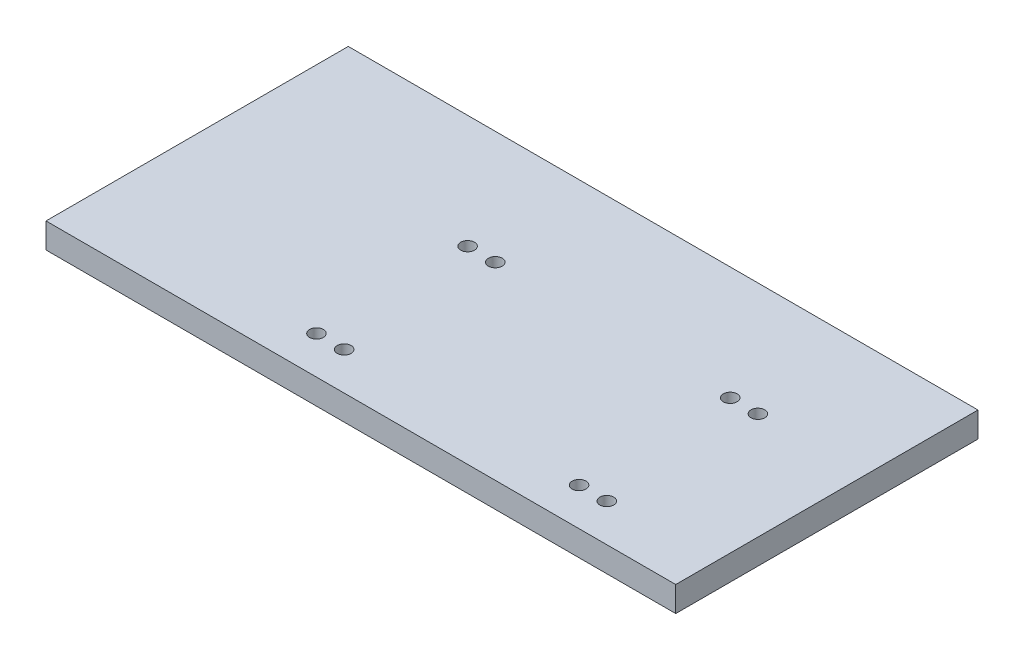
ISO-10303-21;
HEADER;
FILE_DESCRIPTION(('STEP AP214'),'2;1');
FILE_NAME('part.step','',(''),(''),'','','');
FILE_SCHEMA(('AUTOMOTIVE_DESIGN { 1 0 10303 214 1 1 1 1 }'));
ENDSEC;
DATA;
#1=APPLICATION_CONTEXT('core data for automotive mechanical design processes');
#2=APPLICATION_PROTOCOL_DEFINITION('international standard','automotive_design',2000,#1);
#3=PRODUCT_CONTEXT('',#1,'mechanical');
#4=PRODUCT('Part','Part','',(#3));
#5=PRODUCT_RELATED_PRODUCT_CATEGORY('part','',(#4));
#6=PRODUCT_DEFINITION_FORMATION('','',#4);
#7=PRODUCT_DEFINITION_CONTEXT('part definition',#1,'design');
#8=PRODUCT_DEFINITION('design','',#6,#7);
#9=PRODUCT_DEFINITION_SHAPE('','',#8);
#10=(LENGTH_UNIT() NAMED_UNIT(*) SI_UNIT(.MILLI.,.METRE.));
#11=(NAMED_UNIT(*) PLANE_ANGLE_UNIT() SI_UNIT($,.RADIAN.));
#12=(NAMED_UNIT(*) SI_UNIT($,.STERADIAN.) SOLID_ANGLE_UNIT());
#13=UNCERTAINTY_MEASURE_WITH_UNIT(LENGTH_MEASURE(1.E-05),#10,'distance_accuracy_value','');
#14=(GEOMETRIC_REPRESENTATION_CONTEXT(3) GLOBAL_UNCERTAINTY_ASSIGNED_CONTEXT((#13)) GLOBAL_UNIT_ASSIGNED_CONTEXT((#10,
#11,#12)) REPRESENTATION_CONTEXT('',''));
#15=CARTESIAN_POINT('',(0.,0.,0.));
#16=DIRECTION('',(0.,0.,1.));
#17=DIRECTION('',(1.,0.,0.));
#18=AXIS2_PLACEMENT_3D('',#15,#16,#17);
#19=CARTESIAN_POINT('',(0.,0.,0.));
#20=DIRECTION('',(0.,-1.,0.));
#21=DIRECTION('',(0.,0.,-1.));
#22=AXIS2_PLACEMENT_3D('',#19,#20,#21);
#23=PLANE('',#22);
#24=DIRECTION('',(1.,0.,0.));
#25=VECTOR('',#24,1.);
#26=CARTESIAN_POINT('',(103.374418854349,0.,-8.75));
#27=LINE('',#26,#25);
#28=CARTESIAN_POINT('',(92.3744188543491,0.,-8.75));
#29=VERTEX_POINT('',#28);
#30=CARTESIAN_POINT('',(103.374418854349,0.,-8.75));
#31=VERTEX_POINT('',#30);
#32=EDGE_CURVE('E229',#29,#31,#27,.T.);
#33=ORIENTED_EDGE('',*,*,#32,.T.);
#34=CARTESIAN_POINT('',(103.374418854349,0.,-15.));
#35=DIRECTION('',(0.,1.,0.));
#36=DIRECTION('',(0.,0.,-1.));
#37=AXIS2_PLACEMENT_3D('',#34,#35,#36);
#38=CIRCLE('',#37,6.25);
#39=CARTESIAN_POINT('',(103.374418854349,0.,-21.25));
#40=VERTEX_POINT('',#39);
#41=EDGE_CURVE('E59',#31,#40,#38,.T.);
#42=ORIENTED_EDGE('',*,*,#41,.T.);
#43=DIRECTION('',(-1.,0.,0.));
#44=VECTOR('',#43,1.);
#45=CARTESIAN_POINT('',(103.374418854349,0.,-21.25));
#46=LINE('',#45,#44);
#47=CARTESIAN_POINT('',(92.3744188543491,0.,-21.25));
#48=VERTEX_POINT('',#47);
#49=EDGE_CURVE('E221',#40,#48,#46,.T.);
#50=ORIENTED_EDGE('',*,*,#49,.T.);
#51=CARTESIAN_POINT('',(92.3744188543491,0.,-15.));
#52=DIRECTION('',(0.,1.,0.));
#53=DIRECTION('',(0.,0.,-1.));
#54=AXIS2_PLACEMENT_3D('',#51,#52,#53);
#55=CIRCLE('',#54,6.25);
#56=EDGE_CURVE('E232',#48,#29,#55,.T.);
#57=ORIENTED_EDGE('',*,*,#56,.T.);
#58=EDGE_LOOP('',(#33,#42,#50,#57));
#59=FACE_BOUND('',#58,.T.);
#60=CARTESIAN_POINT('',(196.625581145651,0.,-75.));
#61=DIRECTION('',(0.,-1.,0.));
#62=DIRECTION('',(0.,0.,-1.));
#63=AXIS2_PLACEMENT_3D('',#60,#61,#62);
#64=CIRCLE('',#63,6.25000000000001);
#65=CARTESIAN_POINT('',(196.625581145651,0.,-68.75));
#66=VERTEX_POINT('',#65);
#67=CARTESIAN_POINT('',(196.625581145651,0.,-81.25));
#68=VERTEX_POINT('',#67);
#69=EDGE_CURVE('E260',#66,#68,#64,.T.);
#70=ORIENTED_EDGE('',*,*,#69,.F.);
#71=DIRECTION('',(-1.,0.,0.));
#72=VECTOR('',#71,1.);
#73=CARTESIAN_POINT('',(196.625581145651,0.,-68.75));
#74=LINE('',#73,#72);
#75=CARTESIAN_POINT('',(207.625581145651,0.,-68.75));
#76=VERTEX_POINT('',#75);
#77=EDGE_CURVE('E265',#76,#66,#74,.T.);
#78=ORIENTED_EDGE('',*,*,#77,.F.);
#79=CARTESIAN_POINT('',(207.625581145651,0.,-75.));
#80=DIRECTION('',(0.,-1.,0.));
#81=DIRECTION('',(0.,0.,-1.));
#82=AXIS2_PLACEMENT_3D('',#79,#80,#81);
#83=CIRCLE('',#82,6.25000000000002);
#84=CARTESIAN_POINT('',(207.625581145651,0.,-81.25));
#85=VERTEX_POINT('',#84);
#86=EDGE_CURVE('E279',#85,#76,#83,.T.);
#87=ORIENTED_EDGE('',*,*,#86,.F.);
#88=DIRECTION('',(1.,0.,0.));
#89=VECTOR('',#88,1.);
#90=CARTESIAN_POINT('',(196.625581145651,0.,-81.25));
#91=LINE('',#90,#89);
#92=EDGE_CURVE('E276',#68,#85,#91,.T.);
#93=ORIENTED_EDGE('',*,*,#92,.F.);
#94=EDGE_LOOP('',(#70,#78,#87,#93));
#95=FACE_BOUND('',#94,.T.);
#96=CARTESIAN_POINT('',(196.625581145651,0.,-15.));
#97=DIRECTION('',(0.,-1.,0.));
#98=DIRECTION('',(0.,0.,-1.));
#99=AXIS2_PLACEMENT_3D('',#96,#97,#98);
#100=CIRCLE('',#99,6.25);
#101=CARTESIAN_POINT('',(196.625581145651,0.,-8.75));
#102=VERTEX_POINT('',#101);
#103=CARTESIAN_POINT('',(196.625581145651,0.,-21.25));
#104=VERTEX_POINT('',#103);
#105=EDGE_CURVE('E296',#102,#104,#100,.T.);
#106=ORIENTED_EDGE('',*,*,#105,.F.);
#107=DIRECTION('',(-1.,0.,0.));
#108=VECTOR('',#107,1.);
#109=CARTESIAN_POINT('',(196.625581145651,0.,-8.75));
#110=LINE('',#109,#108);
#111=CARTESIAN_POINT('',(207.625581145651,0.,-8.75));
#112=VERTEX_POINT('',#111);
#113=EDGE_CURVE('E301',#112,#102,#110,.T.);
#114=ORIENTED_EDGE('',*,*,#113,.F.);
#115=CARTESIAN_POINT('',(207.625581145651,0.,-15.));
#116=DIRECTION('',(0.,-1.,0.));
#117=DIRECTION('',(0.,0.,-1.));
#118=AXIS2_PLACEMENT_3D('',#115,#116,#117);
#119=CIRCLE('',#118,6.25);
#120=CARTESIAN_POINT('',(207.625581145651,0.,-21.25));
#121=VERTEX_POINT('',#120);
#122=EDGE_CURVE('E315',#121,#112,#119,.T.);
#123=ORIENTED_EDGE('',*,*,#122,.F.);
#124=DIRECTION('',(1.,0.,0.));
#125=VECTOR('',#124,1.);
#126=CARTESIAN_POINT('',(196.625581145651,0.,-21.25));
#127=LINE('',#126,#125);
#128=EDGE_CURVE('E312',#104,#121,#127,.T.);
#129=ORIENTED_EDGE('',*,*,#128,.F.);
#130=EDGE_LOOP('',(#106,#114,#123,#129));
#131=FACE_BOUND('',#130,.T.);
#132=DIRECTION('',(0.,0.,1.));
#133=VECTOR('',#132,1.);
#134=CARTESIAN_POINT('',(0.,0.,0.));
#135=LINE('',#134,#133);
#136=CARTESIAN_POINT('',(0.,0.,-120.));
#137=VERTEX_POINT('',#136);
#138=CARTESIAN_POINT('',(0.,0.,0.));
#139=VERTEX_POINT('',#138);
#140=EDGE_CURVE('E344',#137,#139,#135,.T.);
#141=ORIENTED_EDGE('',*,*,#140,.F.);
#142=DIRECTION('',(-1.,0.,0.));
#143=VECTOR('',#142,1.);
#144=CARTESIAN_POINT('',(0.,0.,-120.));
#145=LINE('',#144,#143);
#146=CARTESIAN_POINT('',(250.,0.,-120.));
#147=VERTEX_POINT('',#146);
#148=EDGE_CURVE('E349',#147,#137,#145,.T.);
#149=ORIENTED_EDGE('',*,*,#148,.F.);
#150=DIRECTION('',(0.,0.,-1.));
#151=VECTOR('',#150,1.);
#152=CARTESIAN_POINT('',(250.,0.,0.));
#153=LINE('',#152,#151);
#154=CARTESIAN_POINT('',(250.,0.,0.));
#155=VERTEX_POINT('',#154);
#156=EDGE_CURVE('E360',#155,#147,#153,.T.);
#157=ORIENTED_EDGE('',*,*,#156,.F.);
#158=DIRECTION('',(1.,0.,0.));
#159=VECTOR('',#158,1.);
#160=CARTESIAN_POINT('',(0.,0.,0.));
#161=LINE('',#160,#159);
#162=EDGE_CURVE('E358',#139,#155,#161,.T.);
#163=ORIENTED_EDGE('',*,*,#162,.F.);
#164=EDGE_LOOP('',(#141,#149,#157,#163));
#165=FACE_BOUND('',#164,.T.);
#166=DIRECTION('',(1.,0.,0.));
#167=VECTOR('',#166,1.);
#168=CARTESIAN_POINT('',(103.374418854349,0.,-68.75));
#169=LINE('',#168,#167);
#170=CARTESIAN_POINT('',(92.3744188543491,0.,-68.75));
#171=VERTEX_POINT('',#170);
#172=CARTESIAN_POINT('',(103.374418854349,0.,-68.75));
#173=VERTEX_POINT('',#172);
#174=EDGE_CURVE('E205',#171,#173,#169,.T.);
#175=ORIENTED_EDGE('',*,*,#174,.T.);
#176=CARTESIAN_POINT('',(103.374418854349,0.,-75.));
#177=DIRECTION('',(0.,1.,0.));
#178=DIRECTION('',(0.,0.,-1.));
#179=AXIS2_PLACEMENT_3D('',#176,#177,#178);
#180=CIRCLE('',#179,6.25000000000001);
#181=CARTESIAN_POINT('',(103.374418854349,0.,-81.25));
#182=VERTEX_POINT('',#181);
#183=EDGE_CURVE('E51',#173,#182,#180,.T.);
#184=ORIENTED_EDGE('',*,*,#183,.T.);
#185=DIRECTION('',(-1.,0.,0.));
#186=VECTOR('',#185,1.);
#187=CARTESIAN_POINT('',(103.374418854349,0.,-81.25));
#188=LINE('',#187,#186);
#189=CARTESIAN_POINT('',(92.3744188543491,0.,-81.25));
#190=VERTEX_POINT('',#189);
#191=EDGE_CURVE('E196',#182,#190,#188,.T.);
#192=ORIENTED_EDGE('',*,*,#191,.T.);
#193=CARTESIAN_POINT('',(92.3744188543491,0.,-75.));
#194=DIRECTION('',(0.,1.,0.));
#195=DIRECTION('',(0.,0.,-1.));
#196=AXIS2_PLACEMENT_3D('',#193,#194,#195);
#197=CIRCLE('',#196,6.25000000000002);
#198=EDGE_CURVE('E199',#190,#171,#197,.T.);
#199=ORIENTED_EDGE('',*,*,#198,.T.);
#200=EDGE_LOOP('',(#175,#184,#192,#199));
#201=FACE_BOUND('',#200,.T.);
#202=ADVANCED_FACE('F34',(#59,#95,#131,#165,#201),#23,.T.);
#203=CARTESIAN_POINT('',(103.374418854349,10.,-75.));
#204=DIRECTION('',(0.,1.,0.));
#205=DIRECTION('',(0.,0.,1.));
#206=AXIS2_PLACEMENT_3D('',#203,#204,#205);
#207=CYLINDRICAL_SURFACE('',#206,2.75);
#208=CARTESIAN_POINT('',(103.374418854349,10.,-75.));
#209=DIRECTION('',(0.,1.,0.));
#210=DIRECTION('',(0.,0.,1.));
#211=AXIS2_PLACEMENT_3D('',#208,#209,#210);
#212=CIRCLE('',#211,2.75);
#213=CARTESIAN_POINT('',(103.374418854349,10.,-72.25));
#214=VERTEX_POINT('',#213);
#215=EDGE_CURVE('E257',#214,#214,#212,.T.);
#216=ORIENTED_EDGE('',*,*,#215,.T.);
#217=EDGE_LOOP('',(#216));
#218=FACE_BOUND('',#217,.T.);
#219=CARTESIAN_POINT('',(103.374418854349,5.,-75.));
#220=DIRECTION('',(0.,-1.,0.));
#221=DIRECTION('',(0.,0.,-1.));
#222=AXIS2_PLACEMENT_3D('',#219,#220,#221);
#223=CIRCLE('',#222,2.75);
#224=CARTESIAN_POINT('',(103.374418854349,5.,-77.75));
#225=VERTEX_POINT('',#224);
#226=EDGE_CURVE('E214',#225,#225,#223,.F.);
#227=ORIENTED_EDGE('',*,*,#226,.F.);
#228=EDGE_LOOP('',(#227));
#229=FACE_BOUND('',#228,.T.);
#230=ADVANCED_FACE('F397',(#218,#229),#207,.F.);
#231=CARTESIAN_POINT('',(92.3744188543491,10.,-75.));
#232=DIRECTION('',(0.,1.,0.));
#233=DIRECTION('',(0.,0.,1.));
#234=AXIS2_PLACEMENT_3D('',#231,#232,#233);
#235=CYLINDRICAL_SURFACE('',#234,2.75);
#236=CARTESIAN_POINT('',(92.3744188543491,10.,-75.));
#237=DIRECTION('',(0.,1.,0.));
#238=DIRECTION('',(0.,0.,1.));
#239=AXIS2_PLACEMENT_3D('',#236,#237,#238);
#240=CIRCLE('',#239,2.75);
#241=CARTESIAN_POINT('',(92.3744188543491,10.,-72.25));
#242=VERTEX_POINT('',#241);
#243=EDGE_CURVE('E254',#242,#242,#240,.T.);
#244=ORIENTED_EDGE('',*,*,#243,.T.);
#245=EDGE_LOOP('',(#244));
#246=FACE_BOUND('',#245,.T.);
#247=CARTESIAN_POINT('',(92.3744188543491,5.,-75.));
#248=DIRECTION('',(0.,-1.,0.));
#249=DIRECTION('',(0.,0.,-1.));
#250=AXIS2_PLACEMENT_3D('',#247,#248,#249);
#251=CIRCLE('',#250,2.75);
#252=CARTESIAN_POINT('',(92.3744188543491,5.,-77.75));
#253=VERTEX_POINT('',#252);
#254=EDGE_CURVE('E38',#253,#253,#251,.F.);
#255=ORIENTED_EDGE('',*,*,#254,.F.);
#256=EDGE_LOOP('',(#255));
#257=FACE_BOUND('',#256,.T.);
#258=ADVANCED_FACE('F392',(#246,#257),#235,.F.);
#259=CARTESIAN_POINT('',(92.3744188543491,10.,-15.));
#260=DIRECTION('',(0.,1.,0.));
#261=DIRECTION('',(0.,0.,1.));
#262=AXIS2_PLACEMENT_3D('',#259,#260,#261);
#263=CYLINDRICAL_SURFACE('',#262,2.75);
#264=CARTESIAN_POINT('',(92.3744188543491,10.,-15.));
#265=DIRECTION('',(0.,1.,0.));
#266=DIRECTION('',(0.,0.,1.));
#267=AXIS2_PLACEMENT_3D('',#264,#265,#266);
#268=CIRCLE('',#267,2.75);
#269=CARTESIAN_POINT('',(92.3744188543491,10.,-12.25));
#270=VERTEX_POINT('',#269);
#271=EDGE_CURVE('E251',#270,#270,#268,.T.);
#272=ORIENTED_EDGE('',*,*,#271,.T.);
#273=EDGE_LOOP('',(#272));
#274=FACE_BOUND('',#273,.T.);
#275=CARTESIAN_POINT('',(92.3744188543491,5.,-15.));
#276=DIRECTION('',(0.,-1.,0.));
#277=DIRECTION('',(0.,0.,-1.));
#278=AXIS2_PLACEMENT_3D('',#275,#276,#277);
#279=CIRCLE('',#278,2.75);
#280=CARTESIAN_POINT('',(92.3744188543491,5.,-17.75));
#281=VERTEX_POINT('',#280);
#282=EDGE_CURVE('E245',#281,#281,#279,.F.);
#283=ORIENTED_EDGE('',*,*,#282,.F.);
#284=EDGE_LOOP('',(#283));
#285=FACE_BOUND('',#284,.T.);
#286=ADVANCED_FACE('F382',(#274,#285),#263,.F.);
#287=CARTESIAN_POINT('',(103.374418854349,10.,-15.));
#288=DIRECTION('',(0.,1.,0.));
#289=DIRECTION('',(0.,0.,1.));
#290=AXIS2_PLACEMENT_3D('',#287,#288,#289);
#291=CYLINDRICAL_SURFACE('',#290,2.75);
#292=CARTESIAN_POINT('',(103.374418854349,10.,-15.));
#293=DIRECTION('',(0.,1.,0.));
#294=DIRECTION('',(0.,0.,1.));
#295=AXIS2_PLACEMENT_3D('',#292,#293,#294);
#296=CIRCLE('',#295,2.75);
#297=CARTESIAN_POINT('',(103.374418854349,10.,-12.25));
#298=VERTEX_POINT('',#297);
#299=EDGE_CURVE('E248',#298,#298,#296,.T.);
#300=ORIENTED_EDGE('',*,*,#299,.T.);
#301=EDGE_LOOP('',(#300));
#302=FACE_BOUND('',#301,.T.);
#303=CARTESIAN_POINT('',(103.374418854349,5.,-15.));
#304=DIRECTION('',(0.,-1.,0.));
#305=DIRECTION('',(0.,0.,-1.));
#306=AXIS2_PLACEMENT_3D('',#303,#304,#305);
#307=CIRCLE('',#306,2.75);
#308=CARTESIAN_POINT('',(103.374418854349,5.,-17.75));
#309=VERTEX_POINT('',#308);
#310=EDGE_CURVE('E239',#309,#309,#307,.F.);
#311=ORIENTED_EDGE('',*,*,#310,.F.);
#312=EDGE_LOOP('',(#311));
#313=FACE_BOUND('',#312,.T.);
#314=ADVANCED_FACE('F379',(#302,#313),#291,.F.);
#315=CARTESIAN_POINT('',(0.,10.,0.));
#316=DIRECTION('',(0.,-1.,0.));
#317=DIRECTION('',(0.,0.,-1.));
#318=AXIS2_PLACEMENT_3D('',#315,#316,#317);
#319=PLANE('',#318);
#320=ORIENTED_EDGE('',*,*,#271,.F.);
#321=EDGE_LOOP('',(#320));
#322=FACE_BOUND('',#321,.T.);
#323=ORIENTED_EDGE('',*,*,#215,.F.);
#324=EDGE_LOOP('',(#323));
#325=FACE_BOUND('',#324,.T.);
#326=CARTESIAN_POINT('',(196.625581145651,10.,-15.));
#327=DIRECTION('',(0.,1.,0.));
#328=DIRECTION('',(0.,0.,1.));
#329=AXIS2_PLACEMENT_3D('',#326,#327,#328);
#330=CIRCLE('',#329,2.75);
#331=CARTESIAN_POINT('',(196.625581145651,10.,-12.25));
#332=VERTEX_POINT('',#331);
#333=EDGE_CURVE('E332',#332,#332,#330,.T.);
#334=ORIENTED_EDGE('',*,*,#333,.F.);
#335=EDGE_LOOP('',(#334));
#336=FACE_BOUND('',#335,.T.);
#337=CARTESIAN_POINT('',(207.625581145651,10.,-15.));
#338=DIRECTION('',(0.,1.,0.));
#339=DIRECTION('',(0.,0.,1.));
#340=AXIS2_PLACEMENT_3D('',#337,#338,#339);
#341=CIRCLE('',#340,2.75);
#342=CARTESIAN_POINT('',(207.625581145651,10.,-12.25));
#343=VERTEX_POINT('',#342);
#344=EDGE_CURVE('E335',#343,#343,#341,.T.);
#345=ORIENTED_EDGE('',*,*,#344,.F.);
#346=EDGE_LOOP('',(#345));
#347=FACE_BOUND('',#346,.T.);
#348=CARTESIAN_POINT('',(207.625581145651,10.,-75.));
#349=DIRECTION('',(0.,1.,0.));
#350=DIRECTION('',(0.,0.,1.));
#351=AXIS2_PLACEMENT_3D('',#348,#349,#350);
#352=CIRCLE('',#351,2.75);
#353=CARTESIAN_POINT('',(207.625581145651,10.,-72.25));
#354=VERTEX_POINT('',#353);
#355=EDGE_CURVE('E338',#354,#354,#352,.T.);
#356=ORIENTED_EDGE('',*,*,#355,.F.);
#357=EDGE_LOOP('',(#356));
#358=FACE_BOUND('',#357,.T.);
#359=CARTESIAN_POINT('',(196.625581145651,10.,-75.));
#360=DIRECTION('',(0.,1.,0.));
#361=DIRECTION('',(0.,0.,1.));
#362=AXIS2_PLACEMENT_3D('',#359,#360,#361);
#363=CIRCLE('',#362,2.75);
#364=CARTESIAN_POINT('',(196.625581145651,10.,-72.25));
#365=VERTEX_POINT('',#364);
#366=EDGE_CURVE('E341',#365,#365,#363,.T.);
#367=ORIENTED_EDGE('',*,*,#366,.F.);
#368=EDGE_LOOP('',(#367));
#369=FACE_BOUND('',#368,.T.);
#370=DIRECTION('',(0.,0.,1.));
#371=VECTOR('',#370,1.);
#372=CARTESIAN_POINT('',(0.,10.,0.));
#373=LINE('',#372,#371);
#374=CARTESIAN_POINT('',(0.,10.,-120.));
#375=VERTEX_POINT('',#374);
#376=CARTESIAN_POINT('',(0.,10.,0.));
#377=VERTEX_POINT('',#376);
#378=EDGE_CURVE('E345',#375,#377,#373,.T.);
#379=ORIENTED_EDGE('',*,*,#378,.T.);
#380=DIRECTION('',(1.,0.,0.));
#381=VECTOR('',#380,1.);
#382=CARTESIAN_POINT('',(0.,10.,0.));
#383=LINE('',#382,#381);
#384=CARTESIAN_POINT('',(250.,10.,0.));
#385=VERTEX_POINT('',#384);
#386=EDGE_CURVE('E348',#377,#385,#383,.T.);
#387=ORIENTED_EDGE('',*,*,#386,.T.);
#388=DIRECTION('',(0.,0.,-1.));
#389=VECTOR('',#388,1.);
#390=CARTESIAN_POINT('',(250.,10.,0.));
#391=LINE('',#390,#389);
#392=CARTESIAN_POINT('',(250.,10.,-120.));
#393=VERTEX_POINT('',#392);
#394=EDGE_CURVE('E351',#385,#393,#391,.T.);
#395=ORIENTED_EDGE('',*,*,#394,.T.);
#396=DIRECTION('',(-1.,0.,0.));
#397=VECTOR('',#396,1.);
#398=CARTESIAN_POINT('',(0.,10.,-120.));
#399=LINE('',#398,#397);
#400=EDGE_CURVE('E353',#393,#375,#399,.T.);
#401=ORIENTED_EDGE('',*,*,#400,.T.);
#402=EDGE_LOOP('',(#379,#387,#395,#401));
#403=FACE_BOUND('',#402,.T.);
#404=ORIENTED_EDGE('',*,*,#243,.F.);
#405=EDGE_LOOP('',(#404));
#406=FACE_BOUND('',#405,.T.);
#407=ORIENTED_EDGE('',*,*,#299,.F.);
#408=EDGE_LOOP('',(#407));
#409=FACE_BOUND('',#408,.T.);
#410=ADVANCED_FACE('F381',(#322,#325,#336,#347,#358,#369,#403,#406,#409),#319,.F.);
#411=CARTESIAN_POINT('',(196.625581145651,10.,-75.));
#412=DIRECTION('',(0.,1.,0.));
#413=DIRECTION('',(0.,0.,1.));
#414=AXIS2_PLACEMENT_3D('',#411,#412,#413);
#415=CYLINDRICAL_SURFACE('',#414,2.75);
#416=ORIENTED_EDGE('',*,*,#366,.T.);
#417=EDGE_LOOP('',(#416));
#418=FACE_BOUND('',#417,.T.);
#419=CARTESIAN_POINT('',(196.625581145651,5.,-75.));
#420=DIRECTION('',(0.,-1.,0.));
#421=DIRECTION('',(0.,0.,-1.));
#422=AXIS2_PLACEMENT_3D('',#419,#420,#421);
#423=CIRCLE('',#422,2.75);
#424=CARTESIAN_POINT('',(196.625581145651,5.,-77.75));
#425=VERTEX_POINT('',#424);
#426=EDGE_CURVE('E293',#425,#425,#423,.F.);
#427=ORIENTED_EDGE('',*,*,#426,.F.);
#428=EDGE_LOOP('',(#427));
#429=FACE_BOUND('',#428,.T.);
#430=ADVANCED_FACE('F389',(#418,#429),#415,.F.);
#431=CARTESIAN_POINT('',(207.625581145651,10.,-75.));
#432=DIRECTION('',(0.,1.,0.));
#433=DIRECTION('',(0.,0.,1.));
#434=AXIS2_PLACEMENT_3D('',#431,#432,#433);
#435=CYLINDRICAL_SURFACE('',#434,2.75);
#436=ORIENTED_EDGE('',*,*,#355,.T.);
#437=EDGE_LOOP('',(#436));
#438=FACE_BOUND('',#437,.T.);
#439=CARTESIAN_POINT('',(207.625581145651,5.,-75.));
#440=DIRECTION('',(0.,-1.,0.));
#441=DIRECTION('',(0.,0.,-1.));
#442=AXIS2_PLACEMENT_3D('',#439,#440,#441);
#443=CIRCLE('',#442,2.75);
#444=CARTESIAN_POINT('',(207.625581145651,5.,-77.75));
#445=VERTEX_POINT('',#444);
#446=EDGE_CURVE('E286',#445,#445,#443,.F.);
#447=ORIENTED_EDGE('',*,*,#446,.F.);
#448=EDGE_LOOP('',(#447));
#449=FACE_BOUND('',#448,.T.);
#450=ADVANCED_FACE('F665',(#438,#449),#435,.F.);
#451=CARTESIAN_POINT('',(207.625581145651,10.,-15.));
#452=DIRECTION('',(0.,1.,0.));
#453=DIRECTION('',(0.,0.,1.));
#454=AXIS2_PLACEMENT_3D('',#451,#452,#453);
#455=CYLINDRICAL_SURFACE('',#454,2.75);
#456=ORIENTED_EDGE('',*,*,#344,.T.);
#457=EDGE_LOOP('',(#456));
#458=FACE_BOUND('',#457,.T.);
#459=CARTESIAN_POINT('',(207.625581145651,5.,-15.));
#460=DIRECTION('',(0.,-1.,0.));
#461=DIRECTION('',(0.,0.,-1.));
#462=AXIS2_PLACEMENT_3D('',#459,#460,#461);
#463=CIRCLE('',#462,2.75);
#464=CARTESIAN_POINT('',(207.625581145651,5.,-17.75));
#465=VERTEX_POINT('',#464);
#466=EDGE_CURVE('E329',#465,#465,#463,.F.);
#467=ORIENTED_EDGE('',*,*,#466,.F.);
#468=EDGE_LOOP('',(#467));
#469=FACE_BOUND('',#468,.T.);
#470=ADVANCED_FACE('F674',(#458,#469),#455,.F.);
#471=CARTESIAN_POINT('',(196.625581145651,10.,-15.));
#472=DIRECTION('',(0.,1.,0.));
#473=DIRECTION('',(0.,0.,1.));
#474=AXIS2_PLACEMENT_3D('',#471,#472,#473);
#475=CYLINDRICAL_SURFACE('',#474,2.75);
#476=ORIENTED_EDGE('',*,*,#333,.T.);
#477=EDGE_LOOP('',(#476));
#478=FACE_BOUND('',#477,.T.);
#479=CARTESIAN_POINT('',(196.625581145651,5.,-15.));
#480=DIRECTION('',(0.,-1.,0.));
#481=DIRECTION('',(0.,0.,-1.));
#482=AXIS2_PLACEMENT_3D('',#479,#480,#481);
#483=CIRCLE('',#482,2.75);
#484=CARTESIAN_POINT('',(196.625581145651,5.,-17.75));
#485=VERTEX_POINT('',#484);
#486=EDGE_CURVE('E322',#485,#485,#483,.F.);
#487=ORIENTED_EDGE('',*,*,#486,.F.);
#488=EDGE_LOOP('',(#487));
#489=FACE_BOUND('',#488,.T.);
#490=ADVANCED_FACE('F422',(#478,#489),#475,.F.);
#491=CARTESIAN_POINT('',(0.,10.,0.));
#492=DIRECTION('',(1.,0.,0.));
#493=DIRECTION('',(0.,0.,-1.));
#494=AXIS2_PLACEMENT_3D('',#491,#492,#493);
#495=PLANE('',#494);
#496=ORIENTED_EDGE('',*,*,#140,.T.);
#497=DIRECTION('',(0.,-1.,0.));
#498=VECTOR('',#497,1.);
#499=CARTESIAN_POINT('',(0.,10.,0.));
#500=LINE('',#499,#498);
#501=EDGE_CURVE('E11',#377,#139,#500,.T.);
#502=ORIENTED_EDGE('',*,*,#501,.F.);
#503=ORIENTED_EDGE('',*,*,#378,.F.);
#504=DIRECTION('',(0.,-1.,0.));
#505=VECTOR('',#504,1.);
#506=CARTESIAN_POINT('',(0.,10.,-120.));
#507=LINE('',#506,#505);
#508=EDGE_CURVE('E355',#375,#137,#507,.T.);
#509=ORIENTED_EDGE('',*,*,#508,.T.);
#510=EDGE_LOOP('',(#496,#502,#503,#509));
#511=FACE_BOUND('',#510,.T.);
#512=ADVANCED_FACE('F36',(#511),#495,.F.);
#513=CARTESIAN_POINT('',(0.,10.,0.));
#514=DIRECTION('',(0.,0.,-1.));
#515=DIRECTION('',(-1.,0.,0.));
#516=AXIS2_PLACEMENT_3D('',#513,#514,#515);
#517=PLANE('',#516);
#518=ORIENTED_EDGE('',*,*,#162,.T.);
#519=DIRECTION('',(0.,-1.,0.));
#520=VECTOR('',#519,1.);
#521=CARTESIAN_POINT('',(250.,10.,0.));
#522=LINE('',#521,#520);
#523=EDGE_CURVE('E43',#385,#155,#522,.T.);
#524=ORIENTED_EDGE('',*,*,#523,.F.);
#525=ORIENTED_EDGE('',*,*,#386,.F.);
#526=ORIENTED_EDGE('',*,*,#501,.T.);
#527=EDGE_LOOP('',(#518,#524,#525,#526));
#528=FACE_BOUND('',#527,.T.);
#529=ADVANCED_FACE('F415',(#528),#517,.F.);
#530=CARTESIAN_POINT('',(250.,10.,0.));
#531=DIRECTION('',(-1.,0.,0.));
#532=DIRECTION('',(0.,0.,1.));
#533=AXIS2_PLACEMENT_3D('',#530,#531,#532);
#534=PLANE('',#533);
#535=ORIENTED_EDGE('',*,*,#156,.T.);
#536=DIRECTION('',(0.,-1.,0.));
#537=VECTOR('',#536,1.);
#538=CARTESIAN_POINT('',(250.,10.,-120.));
#539=LINE('',#538,#537);
#540=EDGE_CURVE('E365',#393,#147,#539,.T.);
#541=ORIENTED_EDGE('',*,*,#540,.F.);
#542=ORIENTED_EDGE('',*,*,#394,.F.);
#543=ORIENTED_EDGE('',*,*,#523,.T.);
#544=EDGE_LOOP('',(#535,#541,#542,#543));
#545=FACE_BOUND('',#544,.T.);
#546=ADVANCED_FACE('F412',(#545),#534,.F.);
#547=CARTESIAN_POINT('',(0.,10.,-120.));
#548=DIRECTION('',(0.,0.,1.));
#549=DIRECTION('',(1.,0.,0.));
#550=AXIS2_PLACEMENT_3D('',#547,#548,#549);
#551=PLANE('',#550);
#552=ORIENTED_EDGE('',*,*,#148,.T.);
#553=ORIENTED_EDGE('',*,*,#508,.F.);
#554=ORIENTED_EDGE('',*,*,#400,.F.);
#555=ORIENTED_EDGE('',*,*,#540,.T.);
#556=EDGE_LOOP('',(#552,#553,#554,#555));
#557=FACE_BOUND('',#556,.T.);
#558=ADVANCED_FACE('F408',(#557),#551,.F.);
#559=CARTESIAN_POINT('',(196.625581145651,5.,-15.));
#560=DIRECTION('',(0.,-1.,0.));
#561=DIRECTION('',(0.,0.,-1.));
#562=AXIS2_PLACEMENT_3D('',#559,#560,#561);
#563=PLANE('',#562);
#564=CARTESIAN_POINT('',(196.625581145651,5.,-15.));
#565=DIRECTION('',(0.,-1.,0.));
#566=DIRECTION('',(0.,0.,-1.));
#567=AXIS2_PLACEMENT_3D('',#564,#565,#566);
#568=CIRCLE('',#567,6.25);
#569=CARTESIAN_POINT('',(196.625581145651,5.,-8.75));
#570=VERTEX_POINT('',#569);
#571=CARTESIAN_POINT('',(196.625581145651,5.,-21.25));
#572=VERTEX_POINT('',#571);
#573=EDGE_CURVE('E297',#570,#572,#568,.T.);
#574=ORIENTED_EDGE('',*,*,#573,.T.);
#575=DIRECTION('',(1.,0.,0.));
#576=VECTOR('',#575,1.);
#577=CARTESIAN_POINT('',(196.625581145651,5.,-21.25));
#578=LINE('',#577,#576);
#579=CARTESIAN_POINT('',(207.625581145651,5.,-21.25));
#580=VERTEX_POINT('',#579);
#581=EDGE_CURVE('E300',#572,#580,#578,.T.);
#582=ORIENTED_EDGE('',*,*,#581,.T.);
#583=CARTESIAN_POINT('',(207.625581145651,5.,-15.));
#584=DIRECTION('',(0.,-1.,0.));
#585=DIRECTION('',(0.,0.,-1.));
#586=AXIS2_PLACEMENT_3D('',#583,#584,#585);
#587=CIRCLE('',#586,6.25);
#588=CARTESIAN_POINT('',(207.625581145651,5.,-8.75));
#589=VERTEX_POINT('',#588);
#590=EDGE_CURVE('E304',#580,#589,#587,.T.);
#591=ORIENTED_EDGE('',*,*,#590,.T.);
#592=DIRECTION('',(-1.,0.,0.));
#593=VECTOR('',#592,1.);
#594=CARTESIAN_POINT('',(196.625581145651,5.,-8.75));
#595=LINE('',#594,#593);
#596=EDGE_CURVE('E307',#589,#570,#595,.T.);
#597=ORIENTED_EDGE('',*,*,#596,.T.);
#598=EDGE_LOOP('',(#574,#582,#591,#597));
#599=FACE_BOUND('',#598,.T.);
#600=ORIENTED_EDGE('',*,*,#486,.T.);
#601=EDGE_LOOP('',(#600));
#602=FACE_BOUND('',#601,.T.);
#603=ORIENTED_EDGE('',*,*,#466,.T.);
#604=EDGE_LOOP('',(#603));
#605=FACE_BOUND('',#604,.T.);
#606=ADVANCED_FACE('F411',(#599,#602,#605),#563,.T.);
#607=CARTESIAN_POINT('',(196.625581145651,5.,-15.));
#608=DIRECTION('',(0.,-1.,0.));
#609=DIRECTION('',(0.,0.,-1.));
#610=AXIS2_PLACEMENT_3D('',#607,#608,#609);
#611=CYLINDRICAL_SURFACE('',#610,6.25);
#612=ORIENTED_EDGE('',*,*,#105,.T.);
#613=DIRECTION('',(0.,-1.,0.));
#614=VECTOR('',#613,1.);
#615=CARTESIAN_POINT('',(196.625581145651,5.,-21.25));
#616=LINE('',#615,#614);
#617=EDGE_CURVE('E310',#572,#104,#616,.T.);
#618=ORIENTED_EDGE('',*,*,#617,.F.);
#619=ORIENTED_EDGE('',*,*,#573,.F.);
#620=DIRECTION('',(0.,-1.,0.));
#621=VECTOR('',#620,1.);
#622=CARTESIAN_POINT('',(196.625581145651,5.,-8.75));
#623=LINE('',#622,#621);
#624=EDGE_CURVE('E320',#570,#102,#623,.T.);
#625=ORIENTED_EDGE('',*,*,#624,.T.);
#626=EDGE_LOOP('',(#612,#618,#619,#625));
#627=FACE_BOUND('',#626,.T.);
#628=ADVANCED_FACE('F639',(#627),#611,.F.);
#629=CARTESIAN_POINT('',(196.625581145651,5.,-8.75));
#630=DIRECTION('',(0.,0.,1.));
#631=DIRECTION('',(1.,0.,0.));
#632=AXIS2_PLACEMENT_3D('',#629,#630,#631);
#633=PLANE('',#632);
#634=ORIENTED_EDGE('',*,*,#113,.T.);
#635=ORIENTED_EDGE('',*,*,#624,.F.);
#636=ORIENTED_EDGE('',*,*,#596,.F.);
#637=DIRECTION('',(0.,-1.,0.));
#638=VECTOR('',#637,1.);
#639=CARTESIAN_POINT('',(207.625581145651,5.,-8.75));
#640=LINE('',#639,#638);
#641=EDGE_CURVE('E323',#589,#112,#640,.T.);
#642=ORIENTED_EDGE('',*,*,#641,.T.);
#643=EDGE_LOOP('',(#634,#635,#636,#642));
#644=FACE_BOUND('',#643,.T.);
#645=ADVANCED_FACE('F630',(#644),#633,.F.);
#646=CARTESIAN_POINT('',(207.625581145651,5.,-15.));
#647=DIRECTION('',(0.,-1.,0.));
#648=DIRECTION('',(0.,0.,-1.));
#649=AXIS2_PLACEMENT_3D('',#646,#647,#648);
#650=CYLINDRICAL_SURFACE('',#649,6.25);
#651=ORIENTED_EDGE('',*,*,#122,.T.);
#652=ORIENTED_EDGE('',*,*,#641,.F.);
#653=ORIENTED_EDGE('',*,*,#590,.F.);
#654=DIRECTION('',(0.,-1.,0.));
#655=VECTOR('',#654,1.);
#656=CARTESIAN_POINT('',(207.625581145651,5.,-21.25));
#657=LINE('',#656,#655);
#658=EDGE_CURVE('E325',#580,#121,#657,.T.);
#659=ORIENTED_EDGE('',*,*,#658,.T.);
#660=EDGE_LOOP('',(#651,#652,#653,#659));
#661=FACE_BOUND('',#660,.T.);
#662=ADVANCED_FACE('F621',(#661),#650,.F.);
#663=CARTESIAN_POINT('',(196.625581145651,5.,-21.25));
#664=DIRECTION('',(0.,0.,-1.));
#665=DIRECTION('',(-1.,0.,0.));
#666=AXIS2_PLACEMENT_3D('',#663,#664,#665);
#667=PLANE('',#666);
#668=ORIENTED_EDGE('',*,*,#128,.T.);
#669=ORIENTED_EDGE('',*,*,#658,.F.);
#670=ORIENTED_EDGE('',*,*,#581,.F.);
#671=ORIENTED_EDGE('',*,*,#617,.T.);
#672=EDGE_LOOP('',(#668,#669,#670,#671));
#673=FACE_BOUND('',#672,.T.);
#674=ADVANCED_FACE('F612',(#673),#667,.F.);
#675=CARTESIAN_POINT('',(196.625581145651,5.,-75.));
#676=DIRECTION('',(0.,-1.,0.));
#677=DIRECTION('',(0.,0.,-1.));
#678=AXIS2_PLACEMENT_3D('',#675,#676,#677);
#679=PLANE('',#678);
#680=CARTESIAN_POINT('',(196.625581145651,5.,-75.));
#681=DIRECTION('',(0.,-1.,0.));
#682=DIRECTION('',(0.,0.,-1.));
#683=AXIS2_PLACEMENT_3D('',#680,#681,#682);
#684=CIRCLE('',#683,6.25000000000001);
#685=CARTESIAN_POINT('',(196.625581145651,5.,-68.75));
#686=VERTEX_POINT('',#685);
#687=CARTESIAN_POINT('',(196.625581145651,5.,-81.25));
#688=VERTEX_POINT('',#687);
#689=EDGE_CURVE('E261',#686,#688,#684,.T.);
#690=ORIENTED_EDGE('',*,*,#689,.T.);
#691=DIRECTION('',(1.,0.,0.));
#692=VECTOR('',#691,1.);
#693=CARTESIAN_POINT('',(196.625581145651,5.,-81.25));
#694=LINE('',#693,#692);
#695=CARTESIAN_POINT('',(207.625581145651,5.,-81.25));
#696=VERTEX_POINT('',#695);
#697=EDGE_CURVE('E264',#688,#696,#694,.T.);
#698=ORIENTED_EDGE('',*,*,#697,.T.);
#699=CARTESIAN_POINT('',(207.625581145651,5.,-75.));
#700=DIRECTION('',(0.,-1.,0.));
#701=DIRECTION('',(0.,0.,-1.));
#702=AXIS2_PLACEMENT_3D('',#699,#700,#701);
#703=CIRCLE('',#702,6.25000000000002);
#704=CARTESIAN_POINT('',(207.625581145651,5.,-68.75));
#705=VERTEX_POINT('',#704);
#706=EDGE_CURVE('E268',#696,#705,#703,.T.);
#707=ORIENTED_EDGE('',*,*,#706,.T.);
#708=DIRECTION('',(-1.,0.,0.));
#709=VECTOR('',#708,1.);
#710=CARTESIAN_POINT('',(196.625581145651,5.,-68.75));
#711=LINE('',#710,#709);
#712=EDGE_CURVE('E271',#705,#686,#711,.T.);
#713=ORIENTED_EDGE('',*,*,#712,.T.);
#714=EDGE_LOOP('',(#690,#698,#707,#713));
#715=FACE_BOUND('',#714,.T.);
#716=ORIENTED_EDGE('',*,*,#446,.T.);
#717=EDGE_LOOP('',(#716));
#718=FACE_BOUND('',#717,.T.);
#719=ORIENTED_EDGE('',*,*,#426,.T.);
#720=EDGE_LOOP('',(#719));
#721=FACE_BOUND('',#720,.T.);
#722=ADVANCED_FACE('F603',(#715,#718,#721),#679,.T.);
#723=CARTESIAN_POINT('',(196.625581145651,5.,-75.));
#724=DIRECTION('',(0.,-1.,0.));
#725=DIRECTION('',(0.,0.,-1.));
#726=AXIS2_PLACEMENT_3D('',#723,#724,#725);
#727=CYLINDRICAL_SURFACE('',#726,6.25000000000001);
#728=ORIENTED_EDGE('',*,*,#69,.T.);
#729=DIRECTION('',(0.,-1.,0.));
#730=VECTOR('',#729,1.);
#731=CARTESIAN_POINT('',(196.625581145651,5.,-81.25));
#732=LINE('',#731,#730);
#733=EDGE_CURVE('E274',#688,#68,#732,.T.);
#734=ORIENTED_EDGE('',*,*,#733,.F.);
#735=ORIENTED_EDGE('',*,*,#689,.F.);
#736=DIRECTION('',(0.,-1.,0.));
#737=VECTOR('',#736,1.);
#738=CARTESIAN_POINT('',(196.625581145651,5.,-68.75));
#739=LINE('',#738,#737);
#740=EDGE_CURVE('E284',#686,#66,#739,.T.);
#741=ORIENTED_EDGE('',*,*,#740,.T.);
#742=EDGE_LOOP('',(#728,#734,#735,#741));
#743=FACE_BOUND('',#742,.T.);
#744=ADVANCED_FACE('F594',(#743),#727,.F.);
#745=CARTESIAN_POINT('',(196.625581145651,5.,-68.75));
#746=DIRECTION('',(0.,0.,1.));
#747=DIRECTION('',(1.,0.,0.));
#748=AXIS2_PLACEMENT_3D('',#745,#746,#747);
#749=PLANE('',#748);
#750=ORIENTED_EDGE('',*,*,#77,.T.);
#751=ORIENTED_EDGE('',*,*,#740,.F.);
#752=ORIENTED_EDGE('',*,*,#712,.F.);
#753=DIRECTION('',(0.,-1.,0.));
#754=VECTOR('',#753,1.);
#755=CARTESIAN_POINT('',(207.625581145651,5.,-68.75));
#756=LINE('',#755,#754);
#757=EDGE_CURVE('E287',#705,#76,#756,.T.);
#758=ORIENTED_EDGE('',*,*,#757,.T.);
#759=EDGE_LOOP('',(#750,#751,#752,#758));
#760=FACE_BOUND('',#759,.T.);
#761=ADVANCED_FACE('F585',(#760),#749,.F.);
#762=CARTESIAN_POINT('',(207.625581145651,5.,-75.));
#763=DIRECTION('',(0.,-1.,0.));
#764=DIRECTION('',(0.,0.,-1.));
#765=AXIS2_PLACEMENT_3D('',#762,#763,#764);
#766=CYLINDRICAL_SURFACE('',#765,6.25000000000002);
#767=ORIENTED_EDGE('',*,*,#86,.T.);
#768=ORIENTED_EDGE('',*,*,#757,.F.);
#769=ORIENTED_EDGE('',*,*,#706,.F.);
#770=DIRECTION('',(0.,-1.,0.));
#771=VECTOR('',#770,1.);
#772=CARTESIAN_POINT('',(207.625581145651,5.,-81.25));
#773=LINE('',#772,#771);
#774=EDGE_CURVE('E289',#696,#85,#773,.T.);
#775=ORIENTED_EDGE('',*,*,#774,.T.);
#776=EDGE_LOOP('',(#767,#768,#769,#775));
#777=FACE_BOUND('',#776,.T.);
#778=ADVANCED_FACE('F576',(#777),#766,.F.);
#779=CARTESIAN_POINT('',(196.625581145651,5.,-81.25));
#780=DIRECTION('',(0.,0.,-1.));
#781=DIRECTION('',(-1.,0.,0.));
#782=AXIS2_PLACEMENT_3D('',#779,#780,#781);
#783=PLANE('',#782);
#784=ORIENTED_EDGE('',*,*,#92,.T.);
#785=ORIENTED_EDGE('',*,*,#774,.F.);
#786=ORIENTED_EDGE('',*,*,#697,.F.);
#787=ORIENTED_EDGE('',*,*,#733,.T.);
#788=EDGE_LOOP('',(#784,#785,#786,#787));
#789=FACE_BOUND('',#788,.T.);
#790=ADVANCED_FACE('F475',(#789),#783,.F.);
#791=CARTESIAN_POINT('',(103.374418854349,5.,-15.));
#792=DIRECTION('',(0.,-1.,0.));
#793=DIRECTION('',(0.,0.,-1.));
#794=AXIS2_PLACEMENT_3D('',#791,#792,#793);
#795=PLANE('',#794);
#796=CARTESIAN_POINT('',(103.374418854349,5.,-15.));
#797=DIRECTION('',(0.,1.,0.));
#798=DIRECTION('',(0.,0.,-1.));
#799=AXIS2_PLACEMENT_3D('',#796,#797,#798);
#800=CIRCLE('',#799,6.25);
#801=CARTESIAN_POINT('',(103.374418854349,5.,-8.75));
#802=VERTEX_POINT('',#801);
#803=CARTESIAN_POINT('',(103.374418854349,5.,-21.25));
#804=VERTEX_POINT('',#803);
#805=EDGE_CURVE('E217',#802,#804,#800,.T.);
#806=ORIENTED_EDGE('',*,*,#805,.F.);
#807=DIRECTION('',(1.,0.,0.));
#808=VECTOR('',#807,1.);
#809=CARTESIAN_POINT('',(103.374418854349,5.,-8.75));
#810=LINE('',#809,#808);
#811=CARTESIAN_POINT('',(92.3744188543491,5.,-8.75));
#812=VERTEX_POINT('',#811);
#813=EDGE_CURVE('E220',#812,#802,#810,.T.);
#814=ORIENTED_EDGE('',*,*,#813,.F.);
#815=CARTESIAN_POINT('',(92.3744188543491,5.,-15.));
#816=DIRECTION('',(0.,1.,0.));
#817=DIRECTION('',(0.,0.,-1.));
#818=AXIS2_PLACEMENT_3D('',#815,#816,#817);
#819=CIRCLE('',#818,6.25);
#820=CARTESIAN_POINT('',(92.3744188543491,5.,-21.25));
#821=VERTEX_POINT('',#820);
#822=EDGE_CURVE('E223',#821,#812,#819,.T.);
#823=ORIENTED_EDGE('',*,*,#822,.F.);
#824=DIRECTION('',(-1.,0.,0.));
#825=VECTOR('',#824,1.);
#826=CARTESIAN_POINT('',(103.374418854349,5.,-21.25));
#827=LINE('',#826,#825);
#828=EDGE_CURVE('E225',#804,#821,#827,.T.);
#829=ORIENTED_EDGE('',*,*,#828,.F.);
#830=EDGE_LOOP('',(#806,#814,#823,#829));
#831=FACE_BOUND('',#830,.T.);
#832=ORIENTED_EDGE('',*,*,#310,.T.);
#833=EDGE_LOOP('',(#832));
#834=FACE_BOUND('',#833,.T.);
#835=ORIENTED_EDGE('',*,*,#282,.T.);
#836=EDGE_LOOP('',(#835));
#837=FACE_BOUND('',#836,.T.);
#838=ADVANCED_FACE('F376',(#831,#834,#837),#795,.T.);
#839=CARTESIAN_POINT('',(103.374418854349,5.,-15.));
#840=DIRECTION('',(0.,-1.,0.));
#841=DIRECTION('',(0.,0.,-1.));
#842=AXIS2_PLACEMENT_3D('',#839,#840,#841);
#843=CYLINDRICAL_SURFACE('',#842,6.25);
#844=ORIENTED_EDGE('',*,*,#41,.F.);
#845=DIRECTION('',(0.,-1.,0.));
#846=VECTOR('',#845,1.);
#847=CARTESIAN_POINT('',(103.374418854349,5.,-8.75));
#848=LINE('',#847,#846);
#849=EDGE_CURVE('E227',#802,#31,#848,.T.);
#850=ORIENTED_EDGE('',*,*,#849,.F.);
#851=ORIENTED_EDGE('',*,*,#805,.T.);
#852=DIRECTION('',(0.,-1.,0.));
#853=VECTOR('',#852,1.);
#854=CARTESIAN_POINT('',(103.374418854349,5.,-21.25));
#855=LINE('',#854,#853);
#856=EDGE_CURVE('E237',#804,#40,#855,.T.);
#857=ORIENTED_EDGE('',*,*,#856,.T.);
#858=EDGE_LOOP('',(#844,#850,#851,#857));
#859=FACE_BOUND('',#858,.T.);
#860=ADVANCED_FACE('F474',(#859),#843,.F.);
#861=CARTESIAN_POINT('',(103.374418854349,5.,-21.25));
#862=DIRECTION('',(0.,0.,1.));
#863=DIRECTION('',(1.,0.,0.));
#864=AXIS2_PLACEMENT_3D('',#861,#862,#863);
#865=PLANE('',#864);
#866=ORIENTED_EDGE('',*,*,#49,.F.);
#867=ORIENTED_EDGE('',*,*,#856,.F.);
#868=ORIENTED_EDGE('',*,*,#828,.T.);
#869=DIRECTION('',(0.,-1.,0.));
#870=VECTOR('',#869,1.);
#871=CARTESIAN_POINT('',(92.3744188543491,5.,-21.25));
#872=LINE('',#871,#870);
#873=EDGE_CURVE('E240',#821,#48,#872,.T.);
#874=ORIENTED_EDGE('',*,*,#873,.T.);
#875=EDGE_LOOP('',(#866,#867,#868,#874));
#876=FACE_BOUND('',#875,.T.);
#877=ADVANCED_FACE('F477',(#876),#865,.T.);
#878=CARTESIAN_POINT('',(92.3744188543491,5.,-15.));
#879=DIRECTION('',(0.,-1.,0.));
#880=DIRECTION('',(0.,0.,-1.));
#881=AXIS2_PLACEMENT_3D('',#878,#879,#880);
#882=CYLINDRICAL_SURFACE('',#881,6.25);
#883=ORIENTED_EDGE('',*,*,#56,.F.);
#884=ORIENTED_EDGE('',*,*,#873,.F.);
#885=ORIENTED_EDGE('',*,*,#822,.T.);
#886=DIRECTION('',(0.,-1.,0.));
#887=VECTOR('',#886,1.);
#888=CARTESIAN_POINT('',(92.3744188543491,5.,-8.75));
#889=LINE('',#888,#887);
#890=EDGE_CURVE('E242',#812,#29,#889,.T.);
#891=ORIENTED_EDGE('',*,*,#890,.T.);
#892=EDGE_LOOP('',(#883,#884,#885,#891));
#893=FACE_BOUND('',#892,.T.);
#894=ADVANCED_FACE('F459',(#893),#882,.F.);
#895=CARTESIAN_POINT('',(103.374418854349,5.,-8.75));
#896=DIRECTION('',(0.,0.,-1.));
#897=DIRECTION('',(-1.,0.,0.));
#898=AXIS2_PLACEMENT_3D('',#895,#896,#897);
#899=PLANE('',#898);
#900=ORIENTED_EDGE('',*,*,#32,.F.);
#901=ORIENTED_EDGE('',*,*,#890,.F.);
#902=ORIENTED_EDGE('',*,*,#813,.T.);
#903=ORIENTED_EDGE('',*,*,#849,.T.);
#904=EDGE_LOOP('',(#900,#901,#902,#903));
#905=FACE_BOUND('',#904,.T.);
#906=ADVANCED_FACE('F449',(#905),#899,.T.);
#907=CARTESIAN_POINT('',(103.374418854349,5.,-75.));
#908=DIRECTION('',(0.,-1.,0.));
#909=DIRECTION('',(0.,0.,-1.));
#910=AXIS2_PLACEMENT_3D('',#907,#908,#909);
#911=PLANE('',#910);
#912=CARTESIAN_POINT('',(103.374418854349,5.,-75.));
#913=DIRECTION('',(0.,1.,0.));
#914=DIRECTION('',(0.,0.,-1.));
#915=AXIS2_PLACEMENT_3D('',#912,#913,#914);
#916=CIRCLE('',#915,6.25000000000001);
#917=CARTESIAN_POINT('',(103.374418854349,5.,-68.75));
#918=VERTEX_POINT('',#917);
#919=CARTESIAN_POINT('',(103.374418854349,5.,-81.25));
#920=VERTEX_POINT('',#919);
#921=EDGE_CURVE('E187',#918,#920,#916,.T.);
#922=ORIENTED_EDGE('',*,*,#921,.F.);
#923=DIRECTION('',(1.,0.,0.));
#924=VECTOR('',#923,1.);
#925=CARTESIAN_POINT('',(103.374418854349,5.,-68.75));
#926=LINE('',#925,#924);
#927=CARTESIAN_POINT('',(92.3744188543491,5.,-68.75));
#928=VERTEX_POINT('',#927);
#929=EDGE_CURVE('E177',#928,#918,#926,.T.);
#930=ORIENTED_EDGE('',*,*,#929,.F.);
#931=CARTESIAN_POINT('',(92.3744188543491,5.,-75.));
#932=DIRECTION('',(0.,1.,0.));
#933=DIRECTION('',(0.,0.,-1.));
#934=AXIS2_PLACEMENT_3D('',#931,#932,#933);
#935=CIRCLE('',#934,6.25000000000002);
#936=CARTESIAN_POINT('',(92.3744188543491,5.,-81.25));
#937=VERTEX_POINT('',#936);
#938=EDGE_CURVE('E186',#937,#928,#935,.T.);
#939=ORIENTED_EDGE('',*,*,#938,.F.);
#940=DIRECTION('',(-1.,0.,0.));
#941=VECTOR('',#940,1.);
#942=CARTESIAN_POINT('',(103.374418854349,5.,-81.25));
#943=LINE('',#942,#941);
#944=EDGE_CURVE('E192',#920,#937,#943,.T.);
#945=ORIENTED_EDGE('',*,*,#944,.F.);
#946=EDGE_LOOP('',(#922,#930,#939,#945));
#947=FACE_BOUND('',#946,.T.);
#948=ORIENTED_EDGE('',*,*,#254,.T.);
#949=EDGE_LOOP('',(#948));
#950=FACE_BOUND('',#949,.T.);
#951=ORIENTED_EDGE('',*,*,#226,.T.);
#952=EDGE_LOOP('',(#951));
#953=FACE_BOUND('',#952,.T.);
#954=ADVANCED_FACE('F194',(#947,#950,#953),#911,.T.);
#955=CARTESIAN_POINT('',(103.374418854349,5.,-75.));
#956=DIRECTION('',(0.,-1.,0.));
#957=DIRECTION('',(0.,0.,-1.));
#958=AXIS2_PLACEMENT_3D('',#955,#956,#957);
#959=CYLINDRICAL_SURFACE('',#958,6.25000000000001);
#960=ORIENTED_EDGE('',*,*,#183,.F.);
#961=DIRECTION('',(0.,-1.,0.));
#962=VECTOR('',#961,1.);
#963=CARTESIAN_POINT('',(103.374418854349,5.,-68.75));
#964=LINE('',#963,#962);
#965=EDGE_CURVE('E180',#918,#173,#964,.T.);
#966=ORIENTED_EDGE('',*,*,#965,.F.);
#967=ORIENTED_EDGE('',*,*,#921,.T.);
#968=DIRECTION('',(0.,-1.,0.));
#969=VECTOR('',#968,1.);
#970=CARTESIAN_POINT('',(103.374418854349,5.,-81.25));
#971=LINE('',#970,#969);
#972=EDGE_CURVE('E209',#920,#182,#971,.T.);
#973=ORIENTED_EDGE('',*,*,#972,.T.);
#974=EDGE_LOOP('',(#960,#966,#967,#973));
#975=FACE_BOUND('',#974,.T.);
#976=ADVANCED_FACE('F190',(#975),#959,.F.);
#977=CARTESIAN_POINT('',(103.374418854349,5.,-81.25));
#978=DIRECTION('',(0.,0.,1.));
#979=DIRECTION('',(1.,0.,0.));
#980=AXIS2_PLACEMENT_3D('',#977,#978,#979);
#981=PLANE('',#980);
#982=ORIENTED_EDGE('',*,*,#191,.F.);
#983=ORIENTED_EDGE('',*,*,#972,.F.);
#984=ORIENTED_EDGE('',*,*,#944,.T.);
#985=DIRECTION('',(0.,-1.,0.));
#986=VECTOR('',#985,1.);
#987=CARTESIAN_POINT('',(92.3744188543491,5.,-81.25));
#988=LINE('',#987,#986);
#989=EDGE_CURVE('E211',#937,#190,#988,.T.);
#990=ORIENTED_EDGE('',*,*,#989,.T.);
#991=EDGE_LOOP('',(#982,#983,#984,#990));
#992=FACE_BOUND('',#991,.T.);
#993=ADVANCED_FACE('F457',(#992),#981,.T.);
#994=CARTESIAN_POINT('',(92.3744188543491,5.,-75.));
#995=DIRECTION('',(0.,-1.,0.));
#996=DIRECTION('',(0.,0.,-1.));
#997=AXIS2_PLACEMENT_3D('',#994,#995,#996);
#998=CYLINDRICAL_SURFACE('',#997,6.25000000000002);
#999=ORIENTED_EDGE('',*,*,#198,.F.);
#1000=ORIENTED_EDGE('',*,*,#989,.F.);
#1001=ORIENTED_EDGE('',*,*,#938,.T.);
#1002=DIRECTION('',(0.,-1.,0.));
#1003=VECTOR('',#1002,1.);
#1004=CARTESIAN_POINT('',(92.3744188543491,5.,-68.75));
#1005=LINE('',#1004,#1003);
#1006=EDGE_CURVE('E182',#928,#171,#1005,.T.);
#1007=ORIENTED_EDGE('',*,*,#1006,.T.);
#1008=EDGE_LOOP('',(#999,#1000,#1001,#1007));
#1009=FACE_BOUND('',#1008,.T.);
#1010=ADVANCED_FACE('F465',(#1009),#998,.F.);
#1011=CARTESIAN_POINT('',(103.374418854349,5.,-68.75));
#1012=DIRECTION('',(0.,0.,-1.));
#1013=DIRECTION('',(-1.,0.,0.));
#1014=AXIS2_PLACEMENT_3D('',#1011,#1012,#1013);
#1015=PLANE('',#1014);
#1016=ORIENTED_EDGE('',*,*,#174,.F.);
#1017=ORIENTED_EDGE('',*,*,#1006,.F.);
#1018=ORIENTED_EDGE('',*,*,#929,.T.);
#1019=ORIENTED_EDGE('',*,*,#965,.T.);
#1020=EDGE_LOOP('',(#1016,#1017,#1018,#1019));
#1021=FACE_BOUND('',#1020,.T.);
#1022=ADVANCED_FACE('F179',(#1021),#1015,.T.);
#1023=CLOSED_SHELL('',(#202,#230,#258,#286,#314,#410,#430,#450,#470,#490,#512,#529,#546,#558,
#606,#628,#645,#662,#674,#722,#744,#761,#778,#790,#838,#860,#877,#894,#906,#954,#976,#993,#1010,#1022));
#1024=MANIFOLD_SOLID_BREP('B2',#1023);
#1025=ADVANCED_BREP_SHAPE_REPRESENTATION('',(#18,#1024),#14);
#1026=SHAPE_DEFINITION_REPRESENTATION(#9,#1025);
ENDSEC;
END-ISO-10303-21;
